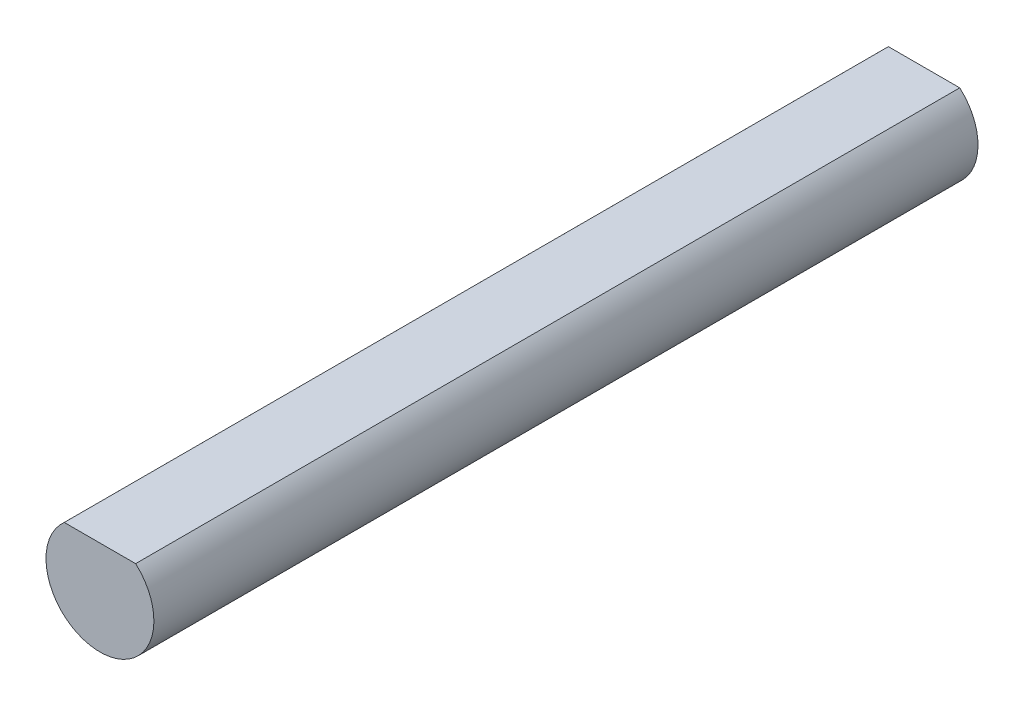
ISO-10303-21;
HEADER;
FILE_DESCRIPTION(('STEP AP214'),'2;1');
FILE_NAME('part.step','',(''),(''),'','','');
FILE_SCHEMA(('AUTOMOTIVE_DESIGN { 1 0 10303 214 1 1 1 1 }'));
ENDSEC;
DATA;
#1=APPLICATION_CONTEXT('core data for automotive mechanical design processes');
#2=APPLICATION_PROTOCOL_DEFINITION('international standard','automotive_design',2000,#1);
#3=PRODUCT_CONTEXT('',#1,'mechanical');
#4=PRODUCT('Part','Part','',(#3));
#5=PRODUCT_RELATED_PRODUCT_CATEGORY('part','',(#4));
#6=PRODUCT_DEFINITION_FORMATION('','',#4);
#7=PRODUCT_DEFINITION_CONTEXT('part definition',#1,'design');
#8=PRODUCT_DEFINITION('design','',#6,#7);
#9=PRODUCT_DEFINITION_SHAPE('','',#8);
#10=(LENGTH_UNIT() NAMED_UNIT(*) SI_UNIT(.MILLI.,.METRE.));
#11=(NAMED_UNIT(*) PLANE_ANGLE_UNIT() SI_UNIT($,.RADIAN.));
#12=(NAMED_UNIT(*) SI_UNIT($,.STERADIAN.) SOLID_ANGLE_UNIT());
#13=UNCERTAINTY_MEASURE_WITH_UNIT(LENGTH_MEASURE(1.E-05),#10,'distance_accuracy_value','');
#14=(GEOMETRIC_REPRESENTATION_CONTEXT(3) GLOBAL_UNCERTAINTY_ASSIGNED_CONTEXT((#13)) GLOBAL_UNIT_ASSIGNED_CONTEXT((#10,
#11,#12)) REPRESENTATION_CONTEXT('',''));
#15=CARTESIAN_POINT('',(0.,0.,0.));
#16=DIRECTION('',(0.,0.,1.));
#17=DIRECTION('',(1.,0.,0.));
#18=AXIS2_PLACEMENT_3D('',#15,#16,#17);
#19=CARTESIAN_POINT('',(0.,0.,-30.55));
#20=DIRECTION('',(0.,0.,1.));
#21=DIRECTION('',(1.,0.,0.));
#22=AXIS2_PLACEMENT_3D('',#19,#20,#21);
#23=CYLINDRICAL_SURFACE('',#22,2.);
#24=CARTESIAN_POINT('',(0.,0.,0.));
#25=DIRECTION('',(0.,0.,1.));
#26=DIRECTION('',(1.,0.,0.));
#27=AXIS2_PLACEMENT_3D('',#24,#25,#26);
#28=CIRCLE('',#27,2.);
#29=CARTESIAN_POINT('',(-1.3228756555323,1.5,0.));
#30=VERTEX_POINT('',#29);
#31=CARTESIAN_POINT('',(1.3228756555323,1.5,0.));
#32=VERTEX_POINT('',#31);
#33=EDGE_CURVE('E61',#30,#32,#28,.T.);
#34=ORIENTED_EDGE('',*,*,#33,.F.);
#35=DIRECTION('',(0.,0.,1.));
#36=VECTOR('',#35,1.);
#37=CARTESIAN_POINT('',(-1.3228756555323,1.5,-30.55));
#38=LINE('',#37,#36);
#39=CARTESIAN_POINT('',(-1.3228756555323,1.5,-30.55));
#40=VERTEX_POINT('',#39);
#41=EDGE_CURVE('E11',#40,#30,#38,.T.);
#42=ORIENTED_EDGE('',*,*,#41,.F.);
#43=CARTESIAN_POINT('',(0.,0.,-30.55));
#44=DIRECTION('',(0.,0.,1.));
#45=DIRECTION('',(1.,0.,0.));
#46=AXIS2_PLACEMENT_3D('',#43,#44,#45);
#47=CIRCLE('',#46,2.);
#48=CARTESIAN_POINT('',(1.3228756555323,1.5,-30.55));
#49=VERTEX_POINT('',#48);
#50=EDGE_CURVE('E65',#40,#49,#47,.T.);
#51=ORIENTED_EDGE('',*,*,#50,.T.);
#52=DIRECTION('',(0.,0.,1.));
#53=VECTOR('',#52,1.);
#54=CARTESIAN_POINT('',(1.3228756555323,1.5,-30.55));
#55=LINE('',#54,#53);
#56=EDGE_CURVE('E35',#49,#32,#55,.T.);
#57=ORIENTED_EDGE('',*,*,#56,.T.);
#58=EDGE_LOOP('',(#34,#42,#51,#57));
#59=FACE_BOUND('',#58,.T.);
#60=ADVANCED_FACE('F32',(#59),#23,.T.);
#61=CARTESIAN_POINT('',(-1.3228756555323,1.5,-30.55));
#62=DIRECTION('',(0.,1.,0.));
#63=DIRECTION('',(0.,0.,1.));
#64=AXIS2_PLACEMENT_3D('',#61,#62,#63);
#65=PLANE('',#64);
#66=DIRECTION('',(-1.,0.,0.));
#67=VECTOR('',#66,1.);
#68=CARTESIAN_POINT('',(-1.3228756555323,1.5,0.));
#69=LINE('',#68,#67);
#70=EDGE_CURVE('E58',#32,#30,#69,.T.);
#71=ORIENTED_EDGE('',*,*,#70,.F.);
#72=ORIENTED_EDGE('',*,*,#56,.F.);
#73=DIRECTION('',(-1.,0.,0.));
#74=VECTOR('',#73,1.);
#75=CARTESIAN_POINT('',(-1.3228756555323,1.5,-30.55));
#76=LINE('',#75,#74);
#77=EDGE_CURVE('E60',#49,#40,#76,.T.);
#78=ORIENTED_EDGE('',*,*,#77,.T.);
#79=ORIENTED_EDGE('',*,*,#41,.T.);
#80=EDGE_LOOP('',(#71,#72,#78,#79));
#81=FACE_BOUND('',#80,.T.);
#82=ADVANCED_FACE('F56',(#81),#65,.T.);
#83=CARTESIAN_POINT('',(0.,0.,-30.55));
#84=DIRECTION('',(0.,0.,1.));
#85=DIRECTION('',(1.,0.,0.));
#86=AXIS2_PLACEMENT_3D('',#83,#84,#85);
#87=PLANE('',#86);
#88=ORIENTED_EDGE('',*,*,#50,.F.);
#89=ORIENTED_EDGE('',*,*,#77,.F.);
#90=EDGE_LOOP('',(#88,#89));
#91=FACE_BOUND('',#90,.T.);
#92=ADVANCED_FACE('F70',(#91),#87,.F.);
#93=CARTESIAN_POINT('',(0.,0.,0.));
#94=DIRECTION('',(0.,0.,1.));
#95=DIRECTION('',(1.,0.,0.));
#96=AXIS2_PLACEMENT_3D('',#93,#94,#95);
#97=PLANE('',#96);
#98=ORIENTED_EDGE('',*,*,#33,.T.);
#99=ORIENTED_EDGE('',*,*,#70,.T.);
#100=EDGE_LOOP('',(#98,#99));
#101=FACE_BOUND('',#100,.T.);
#102=ADVANCED_FACE('F64',(#101),#97,.T.);
#103=CLOSED_SHELL('',(#60,#82,#92,#102));
#104=MANIFOLD_SOLID_BREP('B2',#103);
#105=ADVANCED_BREP_SHAPE_REPRESENTATION('',(#18,#104),#14);
#106=SHAPE_DEFINITION_REPRESENTATION(#9,#105);
ENDSEC;
END-ISO-10303-21;
